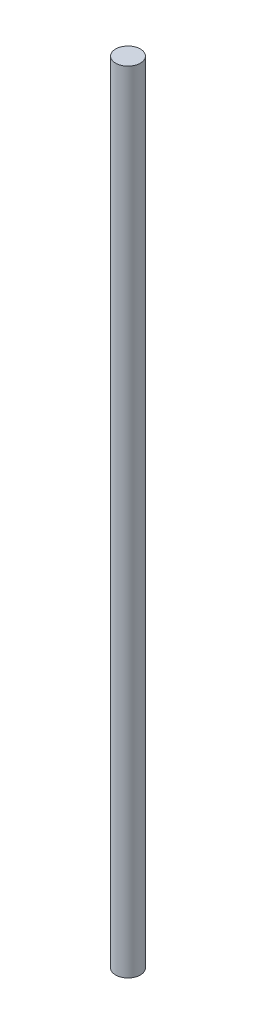
ISO-10303-21;
HEADER;
FILE_DESCRIPTION(('STEP AP214'),'2;1');
FILE_NAME('part.step','',(''),(''),'','','');
FILE_SCHEMA(('AUTOMOTIVE_DESIGN { 1 0 10303 214 1 1 1 1 }'));
ENDSEC;
DATA;
#1=APPLICATION_CONTEXT('core data for automotive mechanical design processes');
#2=APPLICATION_PROTOCOL_DEFINITION('international standard','automotive_design',2000,#1);
#3=PRODUCT_CONTEXT('',#1,'mechanical');
#4=PRODUCT('Part','Part','',(#3));
#5=PRODUCT_RELATED_PRODUCT_CATEGORY('part','',(#4));
#6=PRODUCT_DEFINITION_FORMATION('','',#4);
#7=PRODUCT_DEFINITION_CONTEXT('part definition',#1,'design');
#8=PRODUCT_DEFINITION('design','',#6,#7);
#9=PRODUCT_DEFINITION_SHAPE('','',#8);
#10=(LENGTH_UNIT() NAMED_UNIT(*) SI_UNIT(.MILLI.,.METRE.));
#11=(NAMED_UNIT(*) PLANE_ANGLE_UNIT() SI_UNIT($,.RADIAN.));
#12=(NAMED_UNIT(*) SI_UNIT($,.STERADIAN.) SOLID_ANGLE_UNIT());
#13=UNCERTAINTY_MEASURE_WITH_UNIT(LENGTH_MEASURE(1.E-05),#10,'distance_accuracy_value','');
#14=(GEOMETRIC_REPRESENTATION_CONTEXT(3) GLOBAL_UNCERTAINTY_ASSIGNED_CONTEXT((#13)) GLOBAL_UNIT_ASSIGNED_CONTEXT((#10,
#11,#12)) REPRESENTATION_CONTEXT('',''));
#15=CARTESIAN_POINT('',(0.,0.,0.));
#16=DIRECTION('',(0.,0.,1.));
#17=DIRECTION('',(1.,0.,0.));
#18=AXIS2_PLACEMENT_3D('',#15,#16,#17);
#19=CARTESIAN_POINT('',(0.,304.8,0.));
#20=DIRECTION('',(0.,-1.,0.));
#21=DIRECTION('',(0.,0.,-1.));
#22=AXIS2_PLACEMENT_3D('',#19,#20,#21);
#23=CYLINDRICAL_SURFACE('',#22,4.7625);
#24=CARTESIAN_POINT('',(0.,304.8,0.));
#25=DIRECTION('',(0.,1.,0.));
#26=DIRECTION('',(0.,0.,1.));
#27=AXIS2_PLACEMENT_3D('',#24,#25,#26);
#28=CIRCLE('',#27,4.7625);
#29=CARTESIAN_POINT('',(0.,304.8,4.7625));
#30=VERTEX_POINT('',#29);
#31=EDGE_CURVE('E10',#30,#30,#28,.T.);
#32=ORIENTED_EDGE('',*,*,#31,.F.);
#33=EDGE_LOOP('',(#32));
#34=FACE_BOUND('',#33,.T.);
#35=CARTESIAN_POINT('',(0.,0.,0.));
#36=DIRECTION('',(0.,1.,0.));
#37=DIRECTION('',(0.,0.,1.));
#38=AXIS2_PLACEMENT_3D('',#35,#36,#37);
#39=CIRCLE('',#38,4.7625);
#40=CARTESIAN_POINT('',(0.,0.,4.7625));
#41=VERTEX_POINT('',#40);
#42=EDGE_CURVE('E34',#41,#41,#39,.T.);
#43=ORIENTED_EDGE('',*,*,#42,.T.);
#44=EDGE_LOOP('',(#43));
#45=FACE_BOUND('',#44,.T.);
#46=ADVANCED_FACE('F31',(#34,#45),#23,.T.);
#47=CARTESIAN_POINT('',(0.,304.8,0.));
#48=DIRECTION('',(0.,1.,0.));
#49=DIRECTION('',(0.,0.,1.));
#50=AXIS2_PLACEMENT_3D('',#47,#48,#49);
#51=PLANE('',#50);
#52=ORIENTED_EDGE('',*,*,#31,.T.);
#53=EDGE_LOOP('',(#52));
#54=FACE_BOUND('',#53,.T.);
#55=ADVANCED_FACE('F46',(#54),#51,.T.);
#56=CARTESIAN_POINT('',(0.,0.,0.));
#57=DIRECTION('',(0.,1.,0.));
#58=DIRECTION('',(0.,0.,1.));
#59=AXIS2_PLACEMENT_3D('',#56,#57,#58);
#60=PLANE('',#59);
#61=ORIENTED_EDGE('',*,*,#42,.F.);
#62=EDGE_LOOP('',(#61));
#63=FACE_BOUND('',#62,.T.);
#64=ADVANCED_FACE('F44',(#63),#60,.F.);
#65=CLOSED_SHELL('',(#46,#55,#64));
#66=MANIFOLD_SOLID_BREP('B2',#65);
#67=ADVANCED_BREP_SHAPE_REPRESENTATION('',(#18,#66),#14);
#68=SHAPE_DEFINITION_REPRESENTATION(#9,#67);
ENDSEC;
END-ISO-10303-21;
